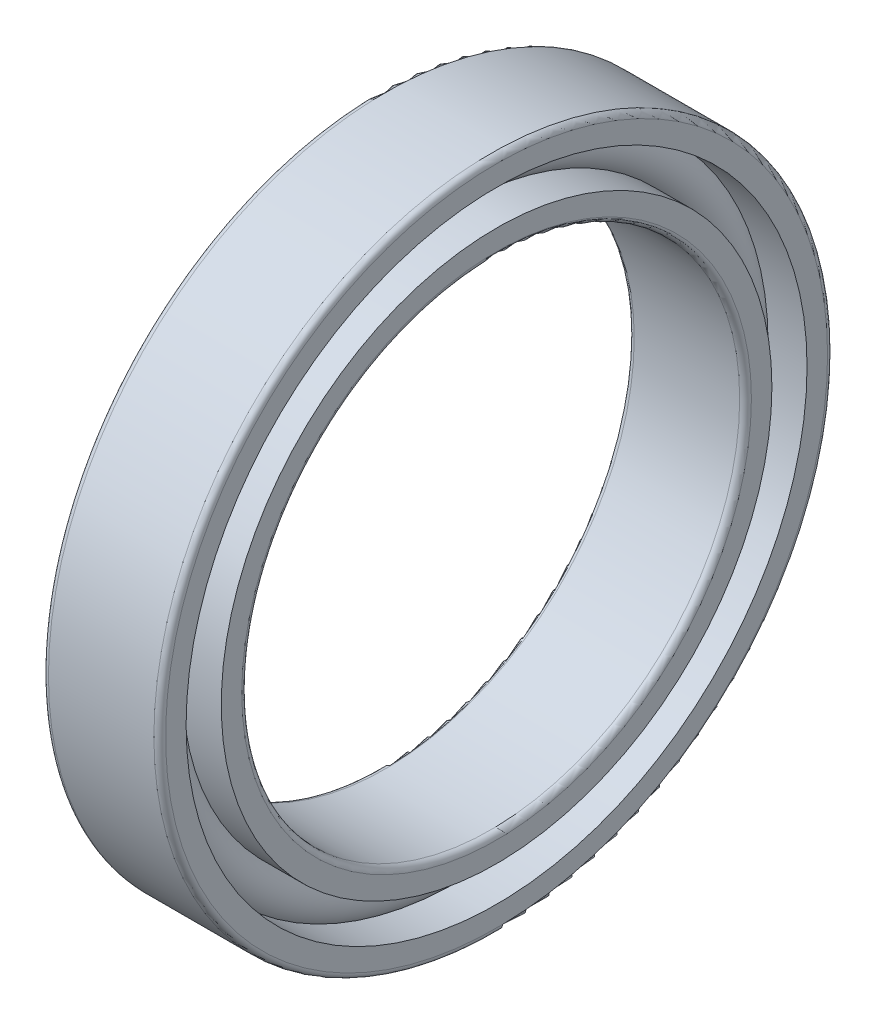
ISO-10303-21;
HEADER;
FILE_DESCRIPTION(('STEP AP214'),'2;1');
FILE_NAME('part.step','',(''),(''),'','','');
FILE_SCHEMA(('AUTOMOTIVE_DESIGN { 1 0 10303 214 1 1 1 1 }'));
ENDSEC;
DATA;
#1=APPLICATION_CONTEXT('core data for automotive mechanical design processes');
#2=APPLICATION_PROTOCOL_DEFINITION('international standard','automotive_design',2000,#1);
#3=PRODUCT_CONTEXT('',#1,'mechanical');
#4=PRODUCT('Part','Part','',(#3));
#5=PRODUCT_RELATED_PRODUCT_CATEGORY('part','',(#4));
#6=PRODUCT_DEFINITION_FORMATION('','',#4);
#7=PRODUCT_DEFINITION_CONTEXT('part definition',#1,'design');
#8=PRODUCT_DEFINITION('design','',#6,#7);
#9=PRODUCT_DEFINITION_SHAPE('','',#8);
#10=(LENGTH_UNIT() NAMED_UNIT(*) SI_UNIT(.MILLI.,.METRE.));
#11=(NAMED_UNIT(*) PLANE_ANGLE_UNIT() SI_UNIT($,.RADIAN.));
#12=(NAMED_UNIT(*) SI_UNIT($,.STERADIAN.) SOLID_ANGLE_UNIT());
#13=UNCERTAINTY_MEASURE_WITH_UNIT(LENGTH_MEASURE(1.E-05),#10,'distance_accuracy_value','');
#14=(GEOMETRIC_REPRESENTATION_CONTEXT(3) GLOBAL_UNCERTAINTY_ASSIGNED_CONTEXT((#13)) GLOBAL_UNIT_ASSIGNED_CONTEXT((#10,
#11,#12)) REPRESENTATION_CONTEXT('',''));
#15=CARTESIAN_POINT('',(0.,0.,0.));
#16=DIRECTION('',(0.,0.,1.));
#17=DIRECTION('',(1.,0.,0.));
#18=AXIS2_PLACEMENT_3D('',#15,#16,#17);
#19=CARTESIAN_POINT('',(0.,0.,0.));
#20=DIRECTION('',(-1.,0.,0.));
#21=DIRECTION('',(0.,0.,1.));
#22=AXIS2_PLACEMENT_3D('',#19,#20,#21);
#23=TOROIDAL_SURFACE('',#22,10.,0.9);
#24=CARTESIAN_POINT('',(0.670820393249932,0.,0.));
#25=DIRECTION('',(-1.,0.,0.));
#26=DIRECTION('',(0.,0.,1.));
#27=AXIS2_PLACEMENT_3D('',#24,#25,#26);
#28=CIRCLE('',#27,10.6);
#29=CARTESIAN_POINT('',(0.670820393249932,0.,10.6));
#30=VERTEX_POINT('',#29);
#31=EDGE_CURVE('E45',#30,#30,#28,.F.);
#32=ORIENTED_EDGE('',*,*,#31,.T.);
#33=EDGE_LOOP('',(#32));
#34=FACE_BOUND('',#33,.T.);
#35=CARTESIAN_POINT('',(0.670820393249938,0.,0.));
#36=DIRECTION('',(-1.,0.,0.));
#37=DIRECTION('',(0.,0.,1.));
#38=AXIS2_PLACEMENT_3D('',#35,#36,#37);
#39=CIRCLE('',#38,9.4);
#40=CARTESIAN_POINT('',(0.670820393249938,0.,9.4));
#41=VERTEX_POINT('',#40);
#42=EDGE_CURVE('E10',#41,#41,#39,.T.);
#43=ORIENTED_EDGE('',*,*,#42,.T.);
#44=EDGE_LOOP('',(#43));
#45=FACE_BOUND('',#44,.T.);
#46=ADVANCED_FACE('F41',(#34,#45),#23,.T.);
#47=CARTESIAN_POINT('',(-20.6375,0.,0.));
#48=DIRECTION('',(1.,0.,0.));
#49=DIRECTION('',(0.,0.,-1.));
#50=AXIS2_PLACEMENT_3D('',#47,#48,#49);
#51=CYLINDRICAL_SURFACE('',#50,9.4);
#52=CARTESIAN_POINT('',(2.,0.,0.));
#53=DIRECTION('',(1.,0.,0.));
#54=DIRECTION('',(0.,0.,-1.));
#55=AXIS2_PLACEMENT_3D('',#52,#53,#54);
#56=CIRCLE('',#55,9.4);
#57=CARTESIAN_POINT('',(2.,0.,-9.4));
#58=VERTEX_POINT('',#57);
#59=EDGE_CURVE('E54',#58,#58,#56,.T.);
#60=ORIENTED_EDGE('',*,*,#59,.F.);
#61=EDGE_LOOP('',(#60));
#62=FACE_BOUND('',#61,.T.);
#63=ORIENTED_EDGE('',*,*,#42,.F.);
#64=EDGE_LOOP('',(#63));
#65=FACE_BOUND('',#64,.T.);
#66=ADVANCED_FACE('F93',(#62,#65),#51,.T.);
#67=CARTESIAN_POINT('',(-20.6375,0.,0.));
#68=DIRECTION('',(1.,0.,0.));
#69=DIRECTION('',(0.,0.,-1.));
#70=AXIS2_PLACEMENT_3D('',#67,#68,#69);
#71=CYLINDRICAL_SURFACE('',#70,9.4);
#72=CARTESIAN_POINT('',(-2.,0.,0.));
#73=DIRECTION('',(1.,0.,0.));
#74=DIRECTION('',(0.,0.,-1.));
#75=AXIS2_PLACEMENT_3D('',#72,#73,#74);
#76=CIRCLE('',#75,9.4);
#77=CARTESIAN_POINT('',(-2.,0.,-9.4));
#78=VERTEX_POINT('',#77);
#79=EDGE_CURVE('E63',#78,#78,#76,.T.);
#80=ORIENTED_EDGE('',*,*,#79,.T.);
#81=EDGE_LOOP('',(#80));
#82=FACE_BOUND('',#81,.T.);
#83=CARTESIAN_POINT('',(-0.670820393249938,0.,0.));
#84=DIRECTION('',(1.,0.,0.));
#85=DIRECTION('',(0.,0.,-1.));
#86=AXIS2_PLACEMENT_3D('',#83,#84,#85);
#87=CIRCLE('',#86,9.4);
#88=CARTESIAN_POINT('',(-0.670820393249938,0.,-9.4));
#89=VERTEX_POINT('',#88);
#90=EDGE_CURVE('E49',#89,#89,#87,.T.);
#91=ORIENTED_EDGE('',*,*,#90,.F.);
#92=EDGE_LOOP('',(#91));
#93=FACE_BOUND('',#92,.T.);
#94=ADVANCED_FACE('F96',(#82,#93),#71,.T.);
#95=CARTESIAN_POINT('',(2.,8.7,0.));
#96=DIRECTION('',(1.,0.,0.));
#97=DIRECTION('',(0.,0.,-1.));
#98=AXIS2_PLACEMENT_3D('',#95,#96,#97);
#99=PLANE('',#98);
#100=ORIENTED_EDGE('',*,*,#59,.T.);
#101=EDGE_LOOP('',(#100));
#102=FACE_BOUND('',#101,.T.);
#103=CARTESIAN_POINT('',(2.,0.,0.));
#104=DIRECTION('',(1.,0.,0.));
#105=DIRECTION('',(0.,0.,-1.));
#106=AXIS2_PLACEMENT_3D('',#103,#104,#105);
#107=CIRCLE('',#106,8.7);
#108=CARTESIAN_POINT('',(2.,0.,-8.7));
#109=VERTEX_POINT('',#108);
#110=EDGE_CURVE('E85',#109,#109,#107,.T.);
#111=ORIENTED_EDGE('',*,*,#110,.F.);
#112=EDGE_LOOP('',(#111));
#113=FACE_BOUND('',#112,.T.);
#114=ADVANCED_FACE('F90',(#102,#113),#99,.T.);
#115=CARTESIAN_POINT('',(1.8,0.,0.));
#116=DIRECTION('',(1.,0.,0.));
#117=DIRECTION('',(0.,0.,-1.));
#118=AXIS2_PLACEMENT_3D('',#115,#116,#117);
#119=TOROIDAL_SURFACE('',#118,8.7,0.2);
#120=ORIENTED_EDGE('',*,*,#110,.T.);
#121=EDGE_LOOP('',(#120));
#122=FACE_BOUND('',#121,.T.);
#123=CARTESIAN_POINT('',(1.8,0.,0.));
#124=DIRECTION('',(1.,0.,0.));
#125=DIRECTION('',(0.,0.,-1.));
#126=AXIS2_PLACEMENT_3D('',#123,#124,#125);
#127=CIRCLE('',#126,8.5);
#128=CARTESIAN_POINT('',(1.8,0.,-8.5));
#129=VERTEX_POINT('',#128);
#130=EDGE_CURVE('E82',#129,#129,#127,.T.);
#131=ORIENTED_EDGE('',*,*,#130,.F.);
#132=EDGE_LOOP('',(#131));
#133=FACE_BOUND('',#132,.T.);
#134=ADVANCED_FACE('F107',(#122,#133),#119,.T.);
#135=CARTESIAN_POINT('',(-20.6375,0.,0.));
#136=DIRECTION('',(1.,0.,0.));
#137=DIRECTION('',(0.,0.,-1.));
#138=AXIS2_PLACEMENT_3D('',#135,#136,#137);
#139=CYLINDRICAL_SURFACE('',#138,8.5);
#140=ORIENTED_EDGE('',*,*,#130,.T.);
#141=EDGE_LOOP('',(#140));
#142=FACE_BOUND('',#141,.T.);
#143=CARTESIAN_POINT('',(-1.8,0.,0.));
#144=DIRECTION('',(1.,0.,0.));
#145=DIRECTION('',(0.,0.,-1.));
#146=AXIS2_PLACEMENT_3D('',#143,#144,#145);
#147=CIRCLE('',#146,8.5);
#148=CARTESIAN_POINT('',(-1.8,0.,-8.5));
#149=VERTEX_POINT('',#148);
#150=EDGE_CURVE('E79',#149,#149,#147,.T.);
#151=ORIENTED_EDGE('',*,*,#150,.F.);
#152=EDGE_LOOP('',(#151));
#153=FACE_BOUND('',#152,.T.);
#154=ADVANCED_FACE('F110',(#142,#153),#139,.F.);
#155=CARTESIAN_POINT('',(-1.8,0.,0.));
#156=DIRECTION('',(1.,0.,0.));
#157=DIRECTION('',(0.,0.,-1.));
#158=AXIS2_PLACEMENT_3D('',#155,#156,#157);
#159=TOROIDAL_SURFACE('',#158,8.7,0.2);
#160=ORIENTED_EDGE('',*,*,#150,.T.);
#161=EDGE_LOOP('',(#160));
#162=FACE_BOUND('',#161,.T.);
#163=CARTESIAN_POINT('',(-2.,0.,0.));
#164=DIRECTION('',(1.,0.,0.));
#165=DIRECTION('',(0.,0.,-1.));
#166=AXIS2_PLACEMENT_3D('',#163,#164,#165);
#167=CIRCLE('',#166,8.7);
#168=CARTESIAN_POINT('',(-2.,0.,-8.7));
#169=VERTEX_POINT('',#168);
#170=EDGE_CURVE('E76',#169,#169,#167,.T.);
#171=ORIENTED_EDGE('',*,*,#170,.F.);
#172=EDGE_LOOP('',(#171));
#173=FACE_BOUND('',#172,.T.);
#174=ADVANCED_FACE('F114',(#162,#173),#159,.T.);
#175=CARTESIAN_POINT('',(-2.,9.4,0.));
#176=DIRECTION('',(-1.,0.,0.));
#177=DIRECTION('',(0.,0.,1.));
#178=AXIS2_PLACEMENT_3D('',#175,#176,#177);
#179=PLANE('',#178);
#180=ORIENTED_EDGE('',*,*,#170,.T.);
#181=EDGE_LOOP('',(#180));
#182=FACE_BOUND('',#181,.T.);
#183=ORIENTED_EDGE('',*,*,#79,.F.);
#184=EDGE_LOOP('',(#183));
#185=FACE_BOUND('',#184,.T.);
#186=ADVANCED_FACE('F118',(#182,#185),#179,.T.);
#187=CARTESIAN_POINT('',(-0.670820393249932,0.,0.));
#188=DIRECTION('',(1.,0.,0.));
#189=DIRECTION('',(0.,0.,-1.));
#190=AXIS2_PLACEMENT_3D('',#187,#188,#189);
#191=CIRCLE('',#190,10.6);
#192=CARTESIAN_POINT('',(-0.670820393249932,0.,-10.6));
#193=VERTEX_POINT('',#192);
#194=EDGE_CURVE('E57',#193,#193,#191,.F.);
#195=ORIENTED_EDGE('',*,*,#194,.T.);
#196=EDGE_LOOP('',(#195));
#197=FACE_BOUND('',#196,.T.);
#198=ORIENTED_EDGE('',*,*,#90,.T.);
#199=EDGE_LOOP('',(#198));
#200=FACE_BOUND('',#199,.T.);
#201=ADVANCED_FACE('F43',(#197,#200),#23,.T.);
#202=CARTESIAN_POINT('',(-20.6375,0.,0.));
#203=DIRECTION('',(1.,0.,0.));
#204=DIRECTION('',(0.,0.,-1.));
#205=AXIS2_PLACEMENT_3D('',#202,#203,#204);
#206=CYLINDRICAL_SURFACE('',#205,10.6);
#207=CARTESIAN_POINT('',(2.,0.,0.));
#208=DIRECTION('',(1.,0.,0.));
#209=DIRECTION('',(0.,0.,-1.));
#210=AXIS2_PLACEMENT_3D('',#207,#208,#209);
#211=CIRCLE('',#210,10.6);
#212=CARTESIAN_POINT('',(2.,0.,-10.6));
#213=VERTEX_POINT('',#212);
#214=EDGE_CURVE('E59',#213,#213,#211,.T.);
#215=ORIENTED_EDGE('',*,*,#214,.T.);
#216=EDGE_LOOP('',(#215));
#217=FACE_BOUND('',#216,.T.);
#218=ORIENTED_EDGE('',*,*,#31,.F.);
#219=EDGE_LOOP('',(#218));
#220=FACE_BOUND('',#219,.T.);
#221=ADVANCED_FACE('F123',(#217,#220),#206,.F.);
#222=CARTESIAN_POINT('',(-20.6375,0.,0.));
#223=DIRECTION('',(1.,0.,0.));
#224=DIRECTION('',(0.,0.,-1.));
#225=AXIS2_PLACEMENT_3D('',#222,#223,#224);
#226=CYLINDRICAL_SURFACE('',#225,10.6);
#227=CARTESIAN_POINT('',(-2.,0.,0.));
#228=DIRECTION('',(1.,0.,0.));
#229=DIRECTION('',(0.,0.,-1.));
#230=AXIS2_PLACEMENT_3D('',#227,#228,#229);
#231=CIRCLE('',#230,10.6);
#232=CARTESIAN_POINT('',(-2.,0.,-10.6));
#233=VERTEX_POINT('',#232);
#234=EDGE_CURVE('E154',#233,#233,#231,.T.);
#235=ORIENTED_EDGE('',*,*,#234,.F.);
#236=EDGE_LOOP('',(#235));
#237=FACE_BOUND('',#236,.T.);
#238=ORIENTED_EDGE('',*,*,#194,.F.);
#239=EDGE_LOOP('',(#238));
#240=FACE_BOUND('',#239,.T.);
#241=ADVANCED_FACE('F126',(#237,#240),#226,.F.);
#242=CARTESIAN_POINT('',(2.,11.3,0.));
#243=DIRECTION('',(1.,0.,0.));
#244=DIRECTION('',(0.,0.,-1.));
#245=AXIS2_PLACEMENT_3D('',#242,#243,#244);
#246=PLANE('',#245);
#247=CARTESIAN_POINT('',(2.,0.,0.));
#248=DIRECTION('',(1.,0.,0.));
#249=DIRECTION('',(0.,0.,-1.));
#250=AXIS2_PLACEMENT_3D('',#247,#248,#249);
#251=CIRCLE('',#250,11.3);
#252=CARTESIAN_POINT('',(2.,0.,-11.3));
#253=VERTEX_POINT('',#252);
#254=EDGE_CURVE('E65',#253,#253,#251,.T.);
#255=ORIENTED_EDGE('',*,*,#254,.T.);
#256=EDGE_LOOP('',(#255));
#257=FACE_BOUND('',#256,.T.);
#258=ORIENTED_EDGE('',*,*,#214,.F.);
#259=EDGE_LOOP('',(#258));
#260=FACE_BOUND('',#259,.T.);
#261=ADVANCED_FACE('F127',(#257,#260),#246,.T.);
#262=CARTESIAN_POINT('',(1.8,0.,0.));
#263=DIRECTION('',(1.,0.,0.));
#264=DIRECTION('',(0.,0.,-1.));
#265=AXIS2_PLACEMENT_3D('',#262,#263,#264);
#266=TOROIDAL_SURFACE('',#265,11.3,0.199999999999999);
#267=CARTESIAN_POINT('',(1.8,0.,0.));
#268=DIRECTION('',(1.,0.,0.));
#269=DIRECTION('',(0.,0.,-1.));
#270=AXIS2_PLACEMENT_3D('',#267,#268,#269);
#271=CIRCLE('',#270,11.5);
#272=CARTESIAN_POINT('',(1.8,0.,-11.5));
#273=VERTEX_POINT('',#272);
#274=EDGE_CURVE('E70',#273,#273,#271,.T.);
#275=ORIENTED_EDGE('',*,*,#274,.T.);
#276=EDGE_LOOP('',(#275));
#277=FACE_BOUND('',#276,.T.);
#278=ORIENTED_EDGE('',*,*,#254,.F.);
#279=EDGE_LOOP('',(#278));
#280=FACE_BOUND('',#279,.T.);
#281=ADVANCED_FACE('F130',(#277,#280),#266,.T.);
#282=CARTESIAN_POINT('',(-20.6375,0.,0.));
#283=DIRECTION('',(1.,0.,0.));
#284=DIRECTION('',(0.,0.,-1.));
#285=AXIS2_PLACEMENT_3D('',#282,#283,#284);
#286=CYLINDRICAL_SURFACE('',#285,11.5);
#287=CARTESIAN_POINT('',(-1.8,0.,0.));
#288=DIRECTION('',(1.,0.,0.));
#289=DIRECTION('',(0.,0.,-1.));
#290=AXIS2_PLACEMENT_3D('',#287,#288,#289);
#291=CIRCLE('',#290,11.5);
#292=CARTESIAN_POINT('',(-1.8,0.,-11.5));
#293=VERTEX_POINT('',#292);
#294=EDGE_CURVE('E158',#293,#293,#291,.T.);
#295=ORIENTED_EDGE('',*,*,#294,.T.);
#296=EDGE_LOOP('',(#295));
#297=FACE_BOUND('',#296,.T.);
#298=ORIENTED_EDGE('',*,*,#274,.F.);
#299=EDGE_LOOP('',(#298));
#300=FACE_BOUND('',#299,.T.);
#301=ADVANCED_FACE('F134',(#297,#300),#286,.T.);
#302=CARTESIAN_POINT('',(-1.8,0.,0.));
#303=DIRECTION('',(1.,0.,0.));
#304=DIRECTION('',(0.,0.,-1.));
#305=AXIS2_PLACEMENT_3D('',#302,#303,#304);
#306=TOROIDAL_SURFACE('',#305,11.3,0.199999999999999);
#307=CARTESIAN_POINT('',(-2.,0.,0.));
#308=DIRECTION('',(1.,0.,0.));
#309=DIRECTION('',(0.,0.,-1.));
#310=AXIS2_PLACEMENT_3D('',#307,#308,#309);
#311=CIRCLE('',#310,11.3);
#312=CARTESIAN_POINT('',(-2.,0.,-11.3));
#313=VERTEX_POINT('',#312);
#314=EDGE_CURVE('E155',#313,#313,#311,.T.);
#315=ORIENTED_EDGE('',*,*,#314,.T.);
#316=EDGE_LOOP('',(#315));
#317=FACE_BOUND('',#316,.T.);
#318=ORIENTED_EDGE('',*,*,#294,.F.);
#319=EDGE_LOOP('',(#318));
#320=FACE_BOUND('',#319,.T.);
#321=ADVANCED_FACE('F138',(#317,#320),#306,.T.);
#322=CARTESIAN_POINT('',(-2.,10.6,0.));
#323=DIRECTION('',(-1.,0.,0.));
#324=DIRECTION('',(0.,0.,1.));
#325=AXIS2_PLACEMENT_3D('',#322,#323,#324);
#326=PLANE('',#325);
#327=ORIENTED_EDGE('',*,*,#234,.T.);
#328=EDGE_LOOP('',(#327));
#329=FACE_BOUND('',#328,.T.);
#330=ORIENTED_EDGE('',*,*,#314,.F.);
#331=EDGE_LOOP('',(#330));
#332=FACE_BOUND('',#331,.T.);
#333=ADVANCED_FACE('F142',(#329,#332),#326,.T.);
#334=CLOSED_SHELL('',(#46,#66,#94,#114,#134,#154,#174,#186,#201,#221,#241,#261,#281,#301,#321,#333));
#335=MANIFOLD_SOLID_BREP('B2',#334);
#336=ADVANCED_BREP_SHAPE_REPRESENTATION('',(#18,#335),#14);
#337=SHAPE_DEFINITION_REPRESENTATION(#9,#336);
ENDSEC;
END-ISO-10303-21;
